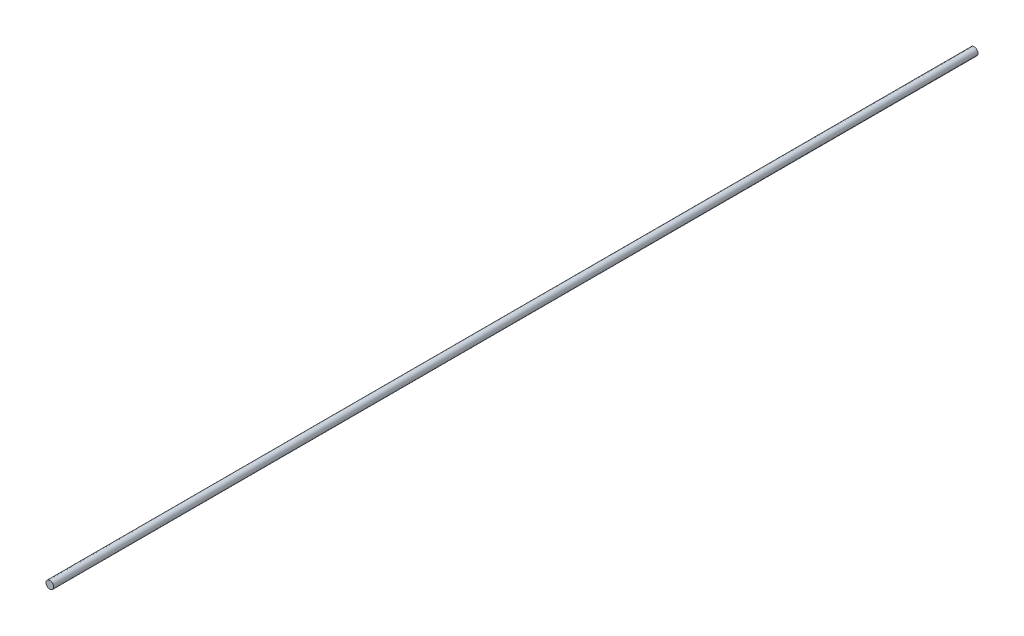
ISO-10303-21;
HEADER;
FILE_DESCRIPTION(('STEP AP214'),'2;1');
FILE_NAME('part.step','',(''),(''),'','','');
FILE_SCHEMA(('AUTOMOTIVE_DESIGN { 1 0 10303 214 1 1 1 1 }'));
ENDSEC;
DATA;
#1=APPLICATION_CONTEXT('core data for automotive mechanical design processes');
#2=APPLICATION_PROTOCOL_DEFINITION('international standard','automotive_design',2000,#1);
#3=PRODUCT_CONTEXT('',#1,'mechanical');
#4=PRODUCT('Part','Part','',(#3));
#5=PRODUCT_RELATED_PRODUCT_CATEGORY('part','',(#4));
#6=PRODUCT_DEFINITION_FORMATION('','',#4);
#7=PRODUCT_DEFINITION_CONTEXT('part definition',#1,'design');
#8=PRODUCT_DEFINITION('design','',#6,#7);
#9=PRODUCT_DEFINITION_SHAPE('','',#8);
#10=(LENGTH_UNIT() NAMED_UNIT(*) SI_UNIT(.MILLI.,.METRE.));
#11=(NAMED_UNIT(*) PLANE_ANGLE_UNIT() SI_UNIT($,.RADIAN.));
#12=(NAMED_UNIT(*) SI_UNIT($,.STERADIAN.) SOLID_ANGLE_UNIT());
#13=UNCERTAINTY_MEASURE_WITH_UNIT(LENGTH_MEASURE(1.E-05),#10,'distance_accuracy_value','');
#14=(GEOMETRIC_REPRESENTATION_CONTEXT(3) GLOBAL_UNCERTAINTY_ASSIGNED_CONTEXT((#13)) GLOBAL_UNIT_ASSIGNED_CONTEXT((#10,
#11,#12)) REPRESENTATION_CONTEXT('',''));
#15=CARTESIAN_POINT('',(0.,0.,0.));
#16=DIRECTION('',(0.,0.,1.));
#17=DIRECTION('',(1.,0.,0.));
#18=AXIS2_PLACEMENT_3D('',#15,#16,#17);
#19=CARTESIAN_POINT('',(0.,0.,241.88));
#20=DIRECTION('',(0.,0.,-1.));
#21=DIRECTION('',(-1.,0.,0.));
#22=AXIS2_PLACEMENT_3D('',#19,#20,#21);
#23=CYLINDRICAL_SURFACE('',#22,1.);
#24=CARTESIAN_POINT('',(0.,0.,241.88));
#25=DIRECTION('',(0.,0.,1.));
#26=DIRECTION('',(1.,0.,0.));
#27=AXIS2_PLACEMENT_3D('',#24,#25,#26);
#28=CIRCLE('',#27,1.);
#29=CARTESIAN_POINT('',(1.,0.,241.88));
#30=VERTEX_POINT('',#29);
#31=EDGE_CURVE('E10',#30,#30,#28,.T.);
#32=ORIENTED_EDGE('',*,*,#31,.F.);
#33=EDGE_LOOP('',(#32));
#34=FACE_BOUND('',#33,.T.);
#35=CARTESIAN_POINT('',(0.,0.,0.));
#36=DIRECTION('',(0.,0.,1.));
#37=DIRECTION('',(1.,0.,0.));
#38=AXIS2_PLACEMENT_3D('',#35,#36,#37);
#39=CIRCLE('',#38,1.);
#40=CARTESIAN_POINT('',(1.,0.,0.));
#41=VERTEX_POINT('',#40);
#42=EDGE_CURVE('E46',#41,#41,#39,.T.);
#43=ORIENTED_EDGE('',*,*,#42,.T.);
#44=EDGE_LOOP('',(#43));
#45=FACE_BOUND('',#44,.T.);
#46=ADVANCED_FACE('F43',(#34,#45),#23,.T.);
#47=CARTESIAN_POINT('',(0.,0.,241.88));
#48=DIRECTION('',(0.,0.,1.));
#49=DIRECTION('',(1.,0.,0.));
#50=AXIS2_PLACEMENT_3D('',#47,#48,#49);
#51=PLANE('',#50);
#52=ORIENTED_EDGE('',*,*,#31,.T.);
#53=EDGE_LOOP('',(#52));
#54=FACE_BOUND('',#53,.T.);
#55=ADVANCED_FACE('F60',(#54),#51,.T.);
#56=CARTESIAN_POINT('',(0.,0.,0.));
#57=DIRECTION('',(0.,0.,1.));
#58=DIRECTION('',(1.,0.,0.));
#59=AXIS2_PLACEMENT_3D('',#56,#57,#58);
#60=PLANE('',#59);
#61=ORIENTED_EDGE('',*,*,#42,.F.);
#62=EDGE_LOOP('',(#61));
#63=FACE_BOUND('',#62,.T.);
#64=ADVANCED_FACE('F58',(#63),#60,.F.);
#65=CLOSED_SHELL('',(#46,#55,#64));
#66=MANIFOLD_SOLID_BREP('B2',#65);
#67=ADVANCED_BREP_SHAPE_REPRESENTATION('',(#18,#66),#14);
#68=SHAPE_DEFINITION_REPRESENTATION(#9,#67);
ENDSEC;
END-ISO-10303-21;
